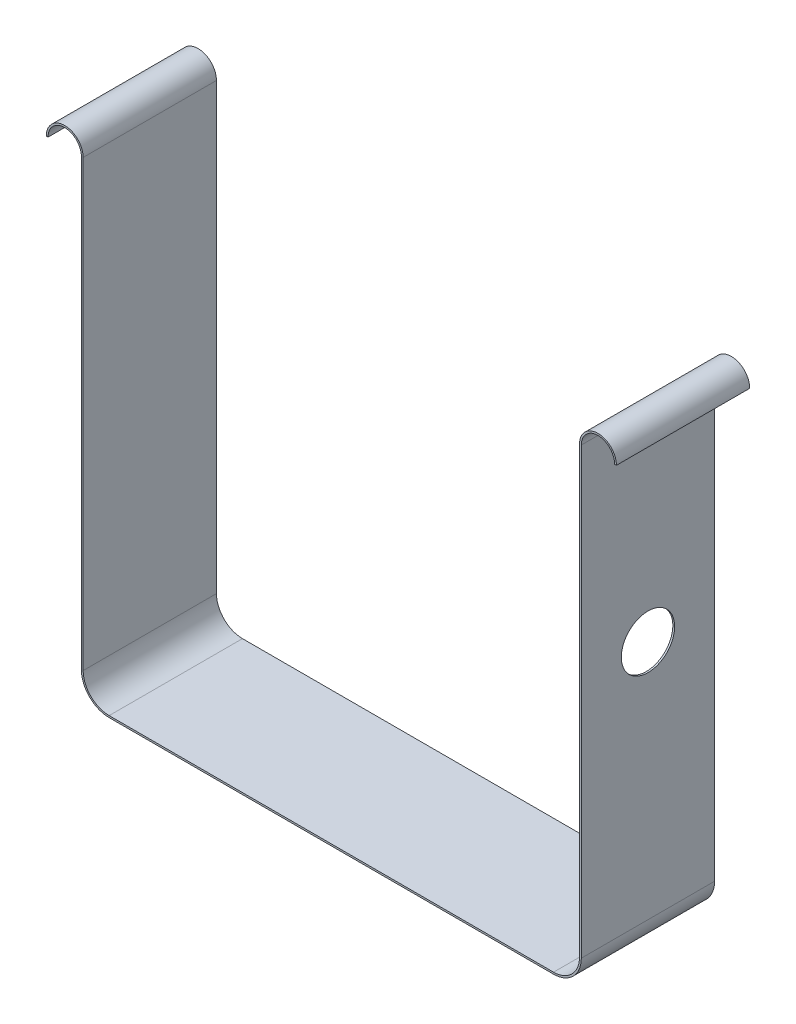
ISO-10303-21;
HEADER;
FILE_DESCRIPTION(('STEP AP214'),'2;1');
FILE_NAME('part.step','',(''),(''),'','','');
FILE_SCHEMA(('AUTOMOTIVE_DESIGN { 1 0 10303 214 1 1 1 1 }'));
ENDSEC;
DATA;
#1=APPLICATION_CONTEXT('core data for automotive mechanical design processes');
#2=APPLICATION_PROTOCOL_DEFINITION('international standard','automotive_design',2000,#1);
#3=PRODUCT_CONTEXT('',#1,'mechanical');
#4=PRODUCT('Part','Part','',(#3));
#5=PRODUCT_RELATED_PRODUCT_CATEGORY('part','',(#4));
#6=PRODUCT_DEFINITION_FORMATION('','',#4);
#7=PRODUCT_DEFINITION_CONTEXT('part definition',#1,'design');
#8=PRODUCT_DEFINITION('design','',#6,#7);
#9=PRODUCT_DEFINITION_SHAPE('','',#8);
#10=(LENGTH_UNIT() NAMED_UNIT(*) SI_UNIT(.MILLI.,.METRE.));
#11=(NAMED_UNIT(*) PLANE_ANGLE_UNIT() SI_UNIT($,.RADIAN.));
#12=(NAMED_UNIT(*) SI_UNIT($,.STERADIAN.) SOLID_ANGLE_UNIT());
#13=UNCERTAINTY_MEASURE_WITH_UNIT(LENGTH_MEASURE(1.E-05),#10,'distance_accuracy_value','');
#14=(GEOMETRIC_REPRESENTATION_CONTEXT(3) GLOBAL_UNCERTAINTY_ASSIGNED_CONTEXT((#13)) GLOBAL_UNIT_ASSIGNED_CONTEXT((#10,
#11,#12)) REPRESENTATION_CONTEXT('',''));
#15=CARTESIAN_POINT('',(0.,0.,0.));
#16=DIRECTION('',(0.,0.,1.));
#17=DIRECTION('',(1.,0.,0.));
#18=AXIS2_PLACEMENT_3D('',#15,#16,#17);
#19=CARTESIAN_POINT('',(-141.859,228.6,-38.1));
#20=DIRECTION('',(1.,0.,0.));
#21=DIRECTION('',(0.,1.,0.));
#22=AXIS2_PLACEMENT_3D('',#19,#20,#21);
#23=PLANE('',#22);
#24=DIRECTION('',(0.,1.,0.));
#25=VECTOR('',#24,1.);
#26=CARTESIAN_POINT('',(-141.859,228.6,38.1));
#27=LINE('',#26,#25);
#28=CARTESIAN_POINT('',(-141.859,-25.4,38.1));
#29=VERTEX_POINT('',#28);
#30=CARTESIAN_POINT('',(-141.859,228.6,38.1));
#31=VERTEX_POINT('',#30);
#32=EDGE_CURVE('E174',#29,#31,#27,.T.);
#33=ORIENTED_EDGE('',*,*,#32,.F.);
#34=DIRECTION('',(0.,0.,1.));
#35=VECTOR('',#34,1.);
#36=CARTESIAN_POINT('',(-141.859,-25.4,-38.1));
#37=LINE('',#36,#35);
#38=CARTESIAN_POINT('',(-141.859,-25.4,-38.1));
#39=VERTEX_POINT('',#38);
#40=EDGE_CURVE('E45',#39,#29,#37,.T.);
#41=ORIENTED_EDGE('',*,*,#40,.F.);
#42=DIRECTION('',(0.,1.,0.));
#43=VECTOR('',#42,1.);
#44=CARTESIAN_POINT('',(-141.859,228.6,-38.1));
#45=LINE('',#44,#43);
#46=CARTESIAN_POINT('',(-141.859,228.6,-38.1));
#47=VERTEX_POINT('',#46);
#48=EDGE_CURVE('E148',#39,#47,#45,.T.);
#49=ORIENTED_EDGE('',*,*,#48,.T.);
#50=DIRECTION('',(0.,0.,1.));
#51=VECTOR('',#50,1.);
#52=CARTESIAN_POINT('',(-141.859,228.6,-38.1));
#53=LINE('',#52,#51);
#54=EDGE_CURVE('E11',#47,#31,#53,.T.);
#55=ORIENTED_EDGE('',*,*,#54,.T.);
#56=EDGE_LOOP('',(#33,#41,#49,#55));
#57=FACE_BOUND('',#56,.T.);
#58=ADVANCED_FACE('F35',(#57),#23,.T.);
#59=CARTESIAN_POINT('',(-127.,-25.4,-38.1));
#60=DIRECTION('',(0.,0.,1.));
#61=DIRECTION('',(1.,0.,0.));
#62=AXIS2_PLACEMENT_3D('',#59,#60,#61);
#63=CYLINDRICAL_SURFACE('',#62,14.859);
#64=CARTESIAN_POINT('',(-127.,-25.4,38.1));
#65=DIRECTION('',(0.,0.,-1.));
#66=DIRECTION('',(-1.,0.,0.));
#67=AXIS2_PLACEMENT_3D('',#64,#65,#66);
#68=CIRCLE('',#67,14.859);
#69=CARTESIAN_POINT('',(-127.,-40.259,38.1));
#70=VERTEX_POINT('',#69);
#71=EDGE_CURVE('E172',#70,#29,#68,.T.);
#72=ORIENTED_EDGE('',*,*,#71,.F.);
#73=DIRECTION('',(0.,0.,1.));
#74=VECTOR('',#73,1.);
#75=CARTESIAN_POINT('',(-127.,-40.259,-38.1));
#76=LINE('',#75,#74);
#77=CARTESIAN_POINT('',(-127.,-40.259,-38.1));
#78=VERTEX_POINT('',#77);
#79=EDGE_CURVE('E89',#78,#70,#76,.T.);
#80=ORIENTED_EDGE('',*,*,#79,.F.);
#81=CARTESIAN_POINT('',(-127.,-25.4,-38.1));
#82=DIRECTION('',(0.,0.,-1.));
#83=DIRECTION('',(-1.,0.,0.));
#84=AXIS2_PLACEMENT_3D('',#81,#82,#83);
#85=CIRCLE('',#84,14.859);
#86=EDGE_CURVE('E138',#78,#39,#85,.T.);
#87=ORIENTED_EDGE('',*,*,#86,.T.);
#88=ORIENTED_EDGE('',*,*,#40,.T.);
#89=EDGE_LOOP('',(#72,#80,#87,#88));
#90=FACE_BOUND('',#89,.T.);
#91=ADVANCED_FACE('F224',(#90),#63,.F.);
#92=CARTESIAN_POINT('',(-127.,-40.259,-38.1));
#93=DIRECTION('',(0.,1.,0.));
#94=DIRECTION('',(-1.,0.,0.));
#95=AXIS2_PLACEMENT_3D('',#92,#93,#94);
#96=PLANE('',#95);
#97=DIRECTION('',(-1.,0.,0.));
#98=VECTOR('',#97,1.);
#99=CARTESIAN_POINT('',(-127.,-40.259,38.1));
#100=LINE('',#99,#98);
#101=CARTESIAN_POINT('',(127.,-40.259,38.1));
#102=VERTEX_POINT('',#101);
#103=EDGE_CURVE('E122',#102,#70,#100,.T.);
#104=ORIENTED_EDGE('',*,*,#103,.F.);
#105=DIRECTION('',(0.,0.,1.));
#106=VECTOR('',#105,1.);
#107=CARTESIAN_POINT('',(127.,-40.259,-38.1));
#108=LINE('',#107,#106);
#109=CARTESIAN_POINT('',(127.,-40.259,-38.1));
#110=VERTEX_POINT('',#109);
#111=EDGE_CURVE('E117',#110,#102,#108,.T.);
#112=ORIENTED_EDGE('',*,*,#111,.F.);
#113=DIRECTION('',(-1.,0.,0.));
#114=VECTOR('',#113,1.);
#115=CARTESIAN_POINT('',(-127.,-40.259,-38.1));
#116=LINE('',#115,#114);
#117=EDGE_CURVE('E120',#110,#78,#116,.T.);
#118=ORIENTED_EDGE('',*,*,#117,.T.);
#119=ORIENTED_EDGE('',*,*,#79,.T.);
#120=EDGE_LOOP('',(#104,#112,#118,#119));
#121=FACE_BOUND('',#120,.T.);
#122=ADVANCED_FACE('F119',(#121),#96,.T.);
#123=CARTESIAN_POINT('',(127.,-25.4,-38.1));
#124=DIRECTION('',(0.,0.,1.));
#125=DIRECTION('',(1.,0.,0.));
#126=AXIS2_PLACEMENT_3D('',#123,#124,#125);
#127=CYLINDRICAL_SURFACE('',#126,14.859);
#128=CARTESIAN_POINT('',(127.,-25.4,38.1));
#129=DIRECTION('',(0.,0.,-1.));
#130=DIRECTION('',(-1.,0.,0.));
#131=AXIS2_PLACEMENT_3D('',#128,#129,#130);
#132=CIRCLE('',#131,14.859);
#133=CARTESIAN_POINT('',(141.859,-25.4,38.1));
#134=VERTEX_POINT('',#133);
#135=EDGE_CURVE('E169',#134,#102,#132,.T.);
#136=ORIENTED_EDGE('',*,*,#135,.F.);
#137=DIRECTION('',(0.,0.,1.));
#138=VECTOR('',#137,1.);
#139=CARTESIAN_POINT('',(141.859,-25.4,-38.1));
#140=LINE('',#139,#138);
#141=CARTESIAN_POINT('',(141.859,-25.4,-38.1));
#142=VERTEX_POINT('',#141);
#143=EDGE_CURVE('E127',#142,#134,#140,.T.);
#144=ORIENTED_EDGE('',*,*,#143,.F.);
#145=CARTESIAN_POINT('',(127.,-25.4,-38.1));
#146=DIRECTION('',(0.,0.,-1.));
#147=DIRECTION('',(-1.,0.,0.));
#148=AXIS2_PLACEMENT_3D('',#145,#146,#147);
#149=CIRCLE('',#148,14.859);
#150=EDGE_CURVE('E135',#142,#110,#149,.T.);
#151=ORIENTED_EDGE('',*,*,#150,.T.);
#152=ORIENTED_EDGE('',*,*,#111,.T.);
#153=EDGE_LOOP('',(#136,#144,#151,#152));
#154=FACE_BOUND('',#153,.T.);
#155=ADVANCED_FACE('F140',(#154),#127,.F.);
#156=CARTESIAN_POINT('',(141.859,-25.4,-38.1));
#157=DIRECTION('',(-1.,0.,0.));
#158=DIRECTION('',(0.,-1.,0.));
#159=AXIS2_PLACEMENT_3D('',#156,#157,#158);
#160=PLANE('',#159);
#161=CARTESIAN_POINT('',(141.859,112.141,0.));
#162=DIRECTION('',(-1.,0.,0.));
#163=DIRECTION('',(0.,-1.,0.));
#164=AXIS2_PLACEMENT_3D('',#161,#162,#163);
#165=CIRCLE('',#164,15.24);
#166=CARTESIAN_POINT('',(141.859,96.9010000000001,0.));
#167=VERTEX_POINT('',#166);
#168=EDGE_CURVE('E346',#167,#167,#165,.F.);
#169=ORIENTED_EDGE('',*,*,#168,.T.);
#170=EDGE_LOOP('',(#169));
#171=FACE_BOUND('',#170,.T.);
#172=DIRECTION('',(0.,-1.,0.));
#173=VECTOR('',#172,1.);
#174=CARTESIAN_POINT('',(141.859,-25.4,38.1));
#175=LINE('',#174,#173);
#176=CARTESIAN_POINT('',(141.859,228.6,38.1));
#177=VERTEX_POINT('',#176);
#178=EDGE_CURVE('E166',#177,#134,#175,.T.);
#179=ORIENTED_EDGE('',*,*,#178,.F.);
#180=DIRECTION('',(0.,0.,1.));
#181=VECTOR('',#180,1.);
#182=CARTESIAN_POINT('',(141.859,228.6,-38.1));
#183=LINE('',#182,#181);
#184=CARTESIAN_POINT('',(141.859,228.6,-38.1));
#185=VERTEX_POINT('',#184);
#186=EDGE_CURVE('E181',#185,#177,#183,.T.);
#187=ORIENTED_EDGE('',*,*,#186,.F.);
#188=DIRECTION('',(0.,-1.,0.));
#189=VECTOR('',#188,1.);
#190=CARTESIAN_POINT('',(141.859,-25.4,-38.1));
#191=LINE('',#190,#189);
#192=EDGE_CURVE('E141',#185,#142,#191,.T.);
#193=ORIENTED_EDGE('',*,*,#192,.T.);
#194=ORIENTED_EDGE('',*,*,#143,.T.);
#195=EDGE_LOOP('',(#179,#187,#193,#194));
#196=FACE_BOUND('',#195,.T.);
#197=ADVANCED_FACE('F236',(#171,#196),#160,.T.);
#198=CARTESIAN_POINT('',(142.875,-25.4,-38.1));
#199=DIRECTION('',(1.,0.,0.));
#200=DIRECTION('',(0.,1.,0.));
#201=AXIS2_PLACEMENT_3D('',#198,#199,#200);
#202=PLANE('',#201);
#203=CARTESIAN_POINT('',(142.875,112.141,0.));
#204=DIRECTION('',(1.,0.,0.));
#205=DIRECTION('',(0.,1.,0.));
#206=AXIS2_PLACEMENT_3D('',#203,#204,#205);
#207=CIRCLE('',#206,15.24);
#208=CARTESIAN_POINT('',(142.875,127.381,0.));
#209=VERTEX_POINT('',#208);
#210=EDGE_CURVE('E338',#209,#209,#207,.T.);
#211=ORIENTED_EDGE('',*,*,#210,.F.);
#212=EDGE_LOOP('',(#211));
#213=FACE_BOUND('',#212,.T.);
#214=DIRECTION('',(0.,1.,0.));
#215=VECTOR('',#214,1.);
#216=CARTESIAN_POINT('',(142.875,-25.4,38.1));
#217=LINE('',#216,#215);
#218=CARTESIAN_POINT('',(142.875,-25.4,38.1));
#219=VERTEX_POINT('',#218);
#220=CARTESIAN_POINT('',(142.875,228.6,38.1));
#221=VERTEX_POINT('',#220);
#222=EDGE_CURVE('E163',#219,#221,#217,.T.);
#223=ORIENTED_EDGE('',*,*,#222,.F.);
#224=DIRECTION('',(0.,0.,1.));
#225=VECTOR('',#224,1.);
#226=CARTESIAN_POINT('',(142.875,-25.4,-38.1));
#227=LINE('',#226,#225);
#228=CARTESIAN_POINT('',(142.875,-25.4,-38.1));
#229=VERTEX_POINT('',#228);
#230=EDGE_CURVE('E186',#229,#219,#227,.T.);
#231=ORIENTED_EDGE('',*,*,#230,.F.);
#232=DIRECTION('',(0.,1.,0.));
#233=VECTOR('',#232,1.);
#234=CARTESIAN_POINT('',(142.875,-25.4,-38.1));
#235=LINE('',#234,#233);
#236=CARTESIAN_POINT('',(142.875,228.6,-38.1));
#237=VERTEX_POINT('',#236);
#238=EDGE_CURVE('E143',#229,#237,#235,.T.);
#239=ORIENTED_EDGE('',*,*,#238,.T.);
#240=DIRECTION('',(0.,0.,1.));
#241=VECTOR('',#240,1.);
#242=CARTESIAN_POINT('',(142.875,228.6,-38.1));
#243=LINE('',#242,#241);
#244=EDGE_CURVE('E183',#237,#221,#243,.T.);
#245=ORIENTED_EDGE('',*,*,#244,.T.);
#246=EDGE_LOOP('',(#223,#231,#239,#245));
#247=FACE_BOUND('',#246,.T.);
#248=ADVANCED_FACE('F239',(#213,#247),#202,.T.);
#249=CARTESIAN_POINT('',(127.,-25.4,-38.1));
#250=DIRECTION('',(0.,0.,1.));
#251=DIRECTION('',(1.,0.,0.));
#252=AXIS2_PLACEMENT_3D('',#249,#250,#251);
#253=CYLINDRICAL_SURFACE('',#252,15.875);
#254=CARTESIAN_POINT('',(127.,-25.4,38.1));
#255=DIRECTION('',(0.,0.,1.));
#256=DIRECTION('',(-1.,0.,0.));
#257=AXIS2_PLACEMENT_3D('',#254,#255,#256);
#258=CIRCLE('',#257,15.875);
#259=CARTESIAN_POINT('',(127.,-41.275,38.1));
#260=VERTEX_POINT('',#259);
#261=EDGE_CURVE('E160',#260,#219,#258,.T.);
#262=ORIENTED_EDGE('',*,*,#261,.F.);
#263=DIRECTION('',(0.,0.,1.));
#264=VECTOR('',#263,1.);
#265=CARTESIAN_POINT('',(127.,-41.275,-38.1));
#266=LINE('',#265,#264);
#267=CARTESIAN_POINT('',(127.,-41.275,-38.1));
#268=VERTEX_POINT('',#267);
#269=EDGE_CURVE('E188',#268,#260,#266,.T.);
#270=ORIENTED_EDGE('',*,*,#269,.F.);
#271=CARTESIAN_POINT('',(127.,-25.4,-38.1));
#272=DIRECTION('',(0.,0.,1.));
#273=DIRECTION('',(-1.,0.,0.));
#274=AXIS2_PLACEMENT_3D('',#271,#272,#273);
#275=CIRCLE('',#274,15.875);
#276=EDGE_CURVE('E259',#268,#229,#275,.T.);
#277=ORIENTED_EDGE('',*,*,#276,.T.);
#278=ORIENTED_EDGE('',*,*,#230,.T.);
#279=EDGE_LOOP('',(#262,#270,#277,#278));
#280=FACE_BOUND('',#279,.T.);
#281=ADVANCED_FACE('F243',(#280),#253,.T.);
#282=CARTESIAN_POINT('',(-127.,-41.275,-38.1));
#283=DIRECTION('',(0.,-1.,0.));
#284=DIRECTION('',(0.,0.,-1.));
#285=AXIS2_PLACEMENT_3D('',#282,#283,#284);
#286=PLANE('',#285);
#287=DIRECTION('',(1.,0.,0.));
#288=VECTOR('',#287,1.);
#289=CARTESIAN_POINT('',(-127.,-41.275,38.1));
#290=LINE('',#289,#288);
#291=CARTESIAN_POINT('',(-127.,-41.275,38.1));
#292=VERTEX_POINT('',#291);
#293=EDGE_CURVE('E157',#292,#260,#290,.T.);
#294=ORIENTED_EDGE('',*,*,#293,.F.);
#295=DIRECTION('',(0.,0.,1.));
#296=VECTOR('',#295,1.);
#297=CARTESIAN_POINT('',(-127.,-41.275,-38.1));
#298=LINE('',#297,#296);
#299=CARTESIAN_POINT('',(-127.,-41.275,-38.1));
#300=VERTEX_POINT('',#299);
#301=EDGE_CURVE('E190',#300,#292,#298,.T.);
#302=ORIENTED_EDGE('',*,*,#301,.F.);
#303=DIRECTION('',(1.,0.,0.));
#304=VECTOR('',#303,1.);
#305=CARTESIAN_POINT('',(-127.,-41.275,-38.1));
#306=LINE('',#305,#304);
#307=EDGE_CURVE('E257',#300,#268,#306,.T.);
#308=ORIENTED_EDGE('',*,*,#307,.T.);
#309=ORIENTED_EDGE('',*,*,#269,.T.);
#310=EDGE_LOOP('',(#294,#302,#308,#309));
#311=FACE_BOUND('',#310,.T.);
#312=ADVANCED_FACE('F222',(#311),#286,.T.);
#313=CARTESIAN_POINT('',(-127.,-25.4,-38.1));
#314=DIRECTION('',(0.,0.,1.));
#315=DIRECTION('',(1.,0.,0.));
#316=AXIS2_PLACEMENT_3D('',#313,#314,#315);
#317=CYLINDRICAL_SURFACE('',#316,15.875);
#318=CARTESIAN_POINT('',(-127.,-25.4,38.1));
#319=DIRECTION('',(0.,0.,1.));
#320=DIRECTION('',(-1.,0.,0.));
#321=AXIS2_PLACEMENT_3D('',#318,#319,#320);
#322=CIRCLE('',#321,15.875);
#323=CARTESIAN_POINT('',(-142.875,-25.3999999999999,38.1));
#324=VERTEX_POINT('',#323);
#325=EDGE_CURVE('E153',#324,#292,#322,.T.);
#326=ORIENTED_EDGE('',*,*,#325,.F.);
#327=DIRECTION('',(0.,0.,1.));
#328=VECTOR('',#327,1.);
#329=CARTESIAN_POINT('',(-142.875,-25.3999999999999,-38.1));
#330=LINE('',#329,#328);
#331=CARTESIAN_POINT('',(-142.875,-25.3999999999999,-38.1));
#332=VERTEX_POINT('',#331);
#333=EDGE_CURVE('E100',#332,#324,#330,.T.);
#334=ORIENTED_EDGE('',*,*,#333,.F.);
#335=CARTESIAN_POINT('',(-127.,-25.4,-38.1));
#336=DIRECTION('',(0.,0.,1.));
#337=DIRECTION('',(-1.,0.,0.));
#338=AXIS2_PLACEMENT_3D('',#335,#336,#337);
#339=CIRCLE('',#338,15.875);
#340=EDGE_CURVE('E256',#332,#300,#339,.T.);
#341=ORIENTED_EDGE('',*,*,#340,.T.);
#342=ORIENTED_EDGE('',*,*,#301,.T.);
#343=EDGE_LOOP('',(#326,#334,#341,#342));
#344=FACE_BOUND('',#343,.T.);
#345=ADVANCED_FACE('F216',(#344),#317,.T.);
#346=CARTESIAN_POINT('',(-142.875,228.6,-38.1));
#347=DIRECTION('',(-1.,0.,0.));
#348=DIRECTION('',(0.,-1.,0.));
#349=AXIS2_PLACEMENT_3D('',#346,#347,#348);
#350=PLANE('',#349);
#351=DIRECTION('',(0.,-1.,0.));
#352=VECTOR('',#351,1.);
#353=CARTESIAN_POINT('',(-142.875,228.6,38.1));
#354=LINE('',#353,#352);
#355=CARTESIAN_POINT('',(-142.875,228.6,38.1));
#356=VERTEX_POINT('',#355);
#357=EDGE_CURVE('E150',#356,#324,#354,.T.);
#358=ORIENTED_EDGE('',*,*,#357,.F.);
#359=DIRECTION('',(0.,0.,1.));
#360=VECTOR('',#359,1.);
#361=CARTESIAN_POINT('',(-142.875,228.6,-38.1));
#362=LINE('',#361,#360);
#363=CARTESIAN_POINT('',(-142.875,228.6,-38.1));
#364=VERTEX_POINT('',#363);
#365=EDGE_CURVE('E39',#364,#356,#362,.T.);
#366=ORIENTED_EDGE('',*,*,#365,.F.);
#367=DIRECTION('',(0.,-1.,0.));
#368=VECTOR('',#367,1.);
#369=CARTESIAN_POINT('',(-142.875,228.6,-38.1));
#370=LINE('',#369,#368);
#371=EDGE_CURVE('E176',#364,#332,#370,.T.);
#372=ORIENTED_EDGE('',*,*,#371,.T.);
#373=ORIENTED_EDGE('',*,*,#333,.T.);
#374=EDGE_LOOP('',(#358,#366,#372,#373));
#375=FACE_BOUND('',#374,.T.);
#376=ADVANCED_FACE('F37',(#375),#350,.T.);
#377=CARTESIAN_POINT('',(-127.,-25.4,-38.1));
#378=DIRECTION('',(0.,0.,-1.));
#379=DIRECTION('',(-1.,0.,0.));
#380=AXIS2_PLACEMENT_3D('',#377,#378,#379);
#381=PLANE('',#380);
#382=ORIENTED_EDGE('',*,*,#371,.F.);
#383=CARTESIAN_POINT('',(-152.4,228.6,-38.1));
#384=DIRECTION('',(0.,0.,-1.));
#385=DIRECTION('',(-1.,0.,0.));
#386=AXIS2_PLACEMENT_3D('',#383,#384,#385);
#387=CIRCLE('',#386,9.52500000000001);
#388=CARTESIAN_POINT('',(-161.925,228.6,-38.1));
#389=VERTEX_POINT('',#388);
#390=EDGE_CURVE('E204',#389,#364,#387,.T.);
#391=ORIENTED_EDGE('',*,*,#390,.F.);
#392=DIRECTION('',(1.,0.,0.));
#393=VECTOR('',#392,1.);
#394=CARTESIAN_POINT('',(-161.925,228.6,-38.1));
#395=LINE('',#394,#393);
#396=CARTESIAN_POINT('',(-162.941,228.6,-38.1));
#397=VERTEX_POINT('',#396);
#398=EDGE_CURVE('E213',#397,#389,#395,.T.);
#399=ORIENTED_EDGE('',*,*,#398,.F.);
#400=CARTESIAN_POINT('',(-152.4,228.6,-38.1));
#401=DIRECTION('',(0.,0.,1.));
#402=DIRECTION('',(-1.,0.,0.));
#403=AXIS2_PLACEMENT_3D('',#400,#401,#402);
#404=CIRCLE('',#403,10.541);
#405=EDGE_CURVE('E312',#47,#397,#404,.T.);
#406=ORIENTED_EDGE('',*,*,#405,.F.);
#407=ORIENTED_EDGE('',*,*,#48,.F.);
#408=ORIENTED_EDGE('',*,*,#86,.F.);
#409=ORIENTED_EDGE('',*,*,#117,.F.);
#410=ORIENTED_EDGE('',*,*,#150,.F.);
#411=ORIENTED_EDGE('',*,*,#192,.F.);
#412=CARTESIAN_POINT('',(152.4,228.6,-38.1));
#413=DIRECTION('',(0.,0.,1.));
#414=DIRECTION('',(1.,0.,0.));
#415=AXIS2_PLACEMENT_3D('',#412,#413,#414);
#416=CIRCLE('',#415,10.541);
#417=CARTESIAN_POINT('',(162.941,228.6,-38.1));
#418=VERTEX_POINT('',#417);
#419=EDGE_CURVE('E333',#418,#185,#416,.T.);
#420=ORIENTED_EDGE('',*,*,#419,.F.);
#421=DIRECTION('',(1.,0.,0.));
#422=VECTOR('',#421,1.);
#423=CARTESIAN_POINT('',(161.925,228.6,-38.1));
#424=LINE('',#423,#422);
#425=CARTESIAN_POINT('',(161.925,228.6,-38.1));
#426=VERTEX_POINT('',#425);
#427=EDGE_CURVE('E335',#426,#418,#424,.T.);
#428=ORIENTED_EDGE('',*,*,#427,.F.);
#429=CARTESIAN_POINT('',(152.4,228.6,-38.1));
#430=DIRECTION('',(0.,0.,-1.));
#431=DIRECTION('',(1.,0.,0.));
#432=AXIS2_PLACEMENT_3D('',#429,#430,#431);
#433=CIRCLE('',#432,9.52500000000001);
#434=EDGE_CURVE('E279',#237,#426,#433,.T.);
#435=ORIENTED_EDGE('',*,*,#434,.F.);
#436=ORIENTED_EDGE('',*,*,#238,.F.);
#437=ORIENTED_EDGE('',*,*,#276,.F.);
#438=ORIENTED_EDGE('',*,*,#307,.F.);
#439=ORIENTED_EDGE('',*,*,#340,.F.);
#440=EDGE_LOOP('',(#382,#391,#399,#406,#407,#408,#409,#410,#411,#420,#428,#435,#436,#437,#438,#439));
#441=FACE_BOUND('',#440,.T.);
#442=ADVANCED_FACE('F133',(#441),#381,.T.);
#443=CARTESIAN_POINT('',(-127.,-25.4,38.1));
#444=DIRECTION('',(0.,0.,-1.));
#445=DIRECTION('',(-1.,0.,0.));
#446=AXIS2_PLACEMENT_3D('',#443,#444,#445);
#447=PLANE('',#446);
#448=ORIENTED_EDGE('',*,*,#32,.T.);
#449=CARTESIAN_POINT('',(-152.4,228.6,38.1));
#450=DIRECTION('',(0.,0.,1.));
#451=DIRECTION('',(-1.,0.,0.));
#452=AXIS2_PLACEMENT_3D('',#449,#450,#451);
#453=CIRCLE('',#452,10.541);
#454=CARTESIAN_POINT('',(-162.941,228.6,38.1));
#455=VERTEX_POINT('',#454);
#456=EDGE_CURVE('E212',#31,#455,#453,.T.);
#457=ORIENTED_EDGE('',*,*,#456,.T.);
#458=DIRECTION('',(1.,0.,0.));
#459=VECTOR('',#458,1.);
#460=CARTESIAN_POINT('',(-161.925,228.6,38.1));
#461=LINE('',#460,#459);
#462=CARTESIAN_POINT('',(-161.925,228.6,38.1));
#463=VERTEX_POINT('',#462);
#464=EDGE_CURVE('E210',#455,#463,#461,.T.);
#465=ORIENTED_EDGE('',*,*,#464,.T.);
#466=CARTESIAN_POINT('',(-152.4,228.6,38.1));
#467=DIRECTION('',(0.,0.,-1.));
#468=DIRECTION('',(-1.,0.,0.));
#469=AXIS2_PLACEMENT_3D('',#466,#467,#468);
#470=CIRCLE('',#469,9.52500000000001);
#471=EDGE_CURVE('E201',#463,#356,#470,.T.);
#472=ORIENTED_EDGE('',*,*,#471,.T.);
#473=ORIENTED_EDGE('',*,*,#357,.T.);
#474=ORIENTED_EDGE('',*,*,#325,.T.);
#475=ORIENTED_EDGE('',*,*,#293,.T.);
#476=ORIENTED_EDGE('',*,*,#261,.T.);
#477=ORIENTED_EDGE('',*,*,#222,.T.);
#478=CARTESIAN_POINT('',(152.4,228.6,38.1));
#479=DIRECTION('',(0.,0.,-1.));
#480=DIRECTION('',(1.,0.,0.));
#481=AXIS2_PLACEMENT_3D('',#478,#479,#480);
#482=CIRCLE('',#481,9.52500000000001);
#483=CARTESIAN_POINT('',(161.925,228.6,38.1));
#484=VERTEX_POINT('',#483);
#485=EDGE_CURVE('E283',#221,#484,#482,.T.);
#486=ORIENTED_EDGE('',*,*,#485,.T.);
#487=DIRECTION('',(1.,0.,0.));
#488=VECTOR('',#487,1.);
#489=CARTESIAN_POINT('',(161.925,228.6,38.1));
#490=LINE('',#489,#488);
#491=CARTESIAN_POINT('',(162.941,228.6,38.1));
#492=VERTEX_POINT('',#491);
#493=EDGE_CURVE('E341',#484,#492,#490,.T.);
#494=ORIENTED_EDGE('',*,*,#493,.T.);
#495=CARTESIAN_POINT('',(152.4,228.6,38.1));
#496=DIRECTION('',(0.,0.,1.));
#497=DIRECTION('',(1.,0.,0.));
#498=AXIS2_PLACEMENT_3D('',#495,#496,#497);
#499=CIRCLE('',#498,10.541);
#500=EDGE_CURVE('E332',#492,#177,#499,.T.);
#501=ORIENTED_EDGE('',*,*,#500,.T.);
#502=ORIENTED_EDGE('',*,*,#178,.T.);
#503=ORIENTED_EDGE('',*,*,#135,.T.);
#504=ORIENTED_EDGE('',*,*,#103,.T.);
#505=ORIENTED_EDGE('',*,*,#71,.T.);
#506=EDGE_LOOP('',(#448,#457,#465,#472,#473,#474,#475,#476,#477,#486,#494,#501,#502,#503,#504,#505));
#507=FACE_BOUND('',#506,.T.);
#508=ADVANCED_FACE('F207',(#507),#447,.F.);
#509=CARTESIAN_POINT('',(-152.4,228.6,38.1));
#510=DIRECTION('',(0.,0.,-1.));
#511=DIRECTION('',(-1.,0.,0.));
#512=AXIS2_PLACEMENT_3D('',#509,#510,#511);
#513=CYLINDRICAL_SURFACE('',#512,9.52500000000001);
#514=ORIENTED_EDGE('',*,*,#390,.T.);
#515=ORIENTED_EDGE('',*,*,#365,.T.);
#516=ORIENTED_EDGE('',*,*,#471,.F.);
#517=DIRECTION('',(0.,0.,-1.));
#518=VECTOR('',#517,1.);
#519=CARTESIAN_POINT('',(-161.925,228.6,38.1));
#520=LINE('',#519,#518);
#521=EDGE_CURVE('E318',#463,#389,#520,.T.);
#522=ORIENTED_EDGE('',*,*,#521,.T.);
#523=EDGE_LOOP('',(#514,#515,#516,#522));
#524=FACE_BOUND('',#523,.T.);
#525=ADVANCED_FACE('F199',(#524),#513,.F.);
#526=CARTESIAN_POINT('',(-152.4,228.6,38.1));
#527=DIRECTION('',(0.,0.,-1.));
#528=DIRECTION('',(-1.,0.,0.));
#529=AXIS2_PLACEMENT_3D('',#526,#527,#528);
#530=CYLINDRICAL_SURFACE('',#529,10.541);
#531=ORIENTED_EDGE('',*,*,#405,.T.);
#532=DIRECTION('',(0.,0.,-1.));
#533=VECTOR('',#532,1.);
#534=CARTESIAN_POINT('',(-162.941,228.6,38.1));
#535=LINE('',#534,#533);
#536=EDGE_CURVE('E154',#455,#397,#535,.T.);
#537=ORIENTED_EDGE('',*,*,#536,.F.);
#538=ORIENTED_EDGE('',*,*,#456,.F.);
#539=ORIENTED_EDGE('',*,*,#54,.F.);
#540=EDGE_LOOP('',(#531,#537,#538,#539));
#541=FACE_BOUND('',#540,.T.);
#542=ADVANCED_FACE('F372',(#541),#530,.T.);
#543=CARTESIAN_POINT('',(-161.925,228.6,38.1));
#544=DIRECTION('',(0.,1.,0.));
#545=DIRECTION('',(0.,0.,1.));
#546=AXIS2_PLACEMENT_3D('',#543,#544,#545);
#547=PLANE('',#546);
#548=ORIENTED_EDGE('',*,*,#398,.T.);
#549=ORIENTED_EDGE('',*,*,#521,.F.);
#550=ORIENTED_EDGE('',*,*,#464,.F.);
#551=ORIENTED_EDGE('',*,*,#536,.T.);
#552=EDGE_LOOP('',(#548,#549,#550,#551));
#553=FACE_BOUND('',#552,.T.);
#554=ADVANCED_FACE('F317',(#553),#547,.F.);
#555=CARTESIAN_POINT('',(152.4,228.6,38.1));
#556=DIRECTION('',(0.,0.,-1.));
#557=DIRECTION('',(-1.,0.,0.));
#558=AXIS2_PLACEMENT_3D('',#555,#556,#557);
#559=CYLINDRICAL_SURFACE('',#558,9.52500000000001);
#560=ORIENTED_EDGE('',*,*,#434,.T.);
#561=DIRECTION('',(0.,0.,-1.));
#562=VECTOR('',#561,1.);
#563=CARTESIAN_POINT('',(161.925,228.6,38.1));
#564=LINE('',#563,#562);
#565=EDGE_CURVE('E321',#484,#426,#564,.T.);
#566=ORIENTED_EDGE('',*,*,#565,.F.);
#567=ORIENTED_EDGE('',*,*,#485,.F.);
#568=ORIENTED_EDGE('',*,*,#244,.F.);
#569=EDGE_LOOP('',(#560,#566,#567,#568));
#570=FACE_BOUND('',#569,.T.);
#571=ADVANCED_FACE('F366',(#570),#559,.F.);
#572=CARTESIAN_POINT('',(161.925,228.6,38.1));
#573=DIRECTION('',(0.,1.,0.));
#574=DIRECTION('',(0.,0.,1.));
#575=AXIS2_PLACEMENT_3D('',#572,#573,#574);
#576=PLANE('',#575);
#577=ORIENTED_EDGE('',*,*,#427,.T.);
#578=DIRECTION('',(0.,0.,-1.));
#579=VECTOR('',#578,1.);
#580=CARTESIAN_POINT('',(162.941,228.6,38.1));
#581=LINE('',#580,#579);
#582=EDGE_CURVE('E325',#492,#418,#581,.T.);
#583=ORIENTED_EDGE('',*,*,#582,.F.);
#584=ORIENTED_EDGE('',*,*,#493,.F.);
#585=ORIENTED_EDGE('',*,*,#565,.T.);
#586=EDGE_LOOP('',(#577,#583,#584,#585));
#587=FACE_BOUND('',#586,.T.);
#588=ADVANCED_FACE('F360',(#587),#576,.F.);
#589=CARTESIAN_POINT('',(152.4,228.6,38.1));
#590=DIRECTION('',(0.,0.,-1.));
#591=DIRECTION('',(-1.,0.,0.));
#592=AXIS2_PLACEMENT_3D('',#589,#590,#591);
#593=CYLINDRICAL_SURFACE('',#592,10.541);
#594=ORIENTED_EDGE('',*,*,#419,.T.);
#595=ORIENTED_EDGE('',*,*,#186,.T.);
#596=ORIENTED_EDGE('',*,*,#500,.F.);
#597=ORIENTED_EDGE('',*,*,#582,.T.);
#598=EDGE_LOOP('',(#594,#595,#596,#597));
#599=FACE_BOUND('',#598,.T.);
#600=ADVANCED_FACE('F354',(#599),#593,.T.);
#601=CARTESIAN_POINT('',(-162.942,112.141,0.));
#602=DIRECTION('',(1.,0.,0.));
#603=DIRECTION('',(0.,1.,0.));
#604=AXIS2_PLACEMENT_3D('',#601,#602,#603);
#605=CYLINDRICAL_SURFACE('',#604,15.24);
#606=ORIENTED_EDGE('',*,*,#168,.F.);
#607=EDGE_LOOP('',(#606));
#608=FACE_BOUND('',#607,.T.);
#609=ORIENTED_EDGE('',*,*,#210,.T.);
#610=EDGE_LOOP('',(#609));
#611=FACE_BOUND('',#610,.T.);
#612=ADVANCED_FACE('F351',(#608,#611),#605,.F.);
#613=CLOSED_SHELL('',(#58,#91,#122,#155,#197,#248,#281,#312,#345,#376,#442,#508,#525,#542,#554,
#571,#588,#600,#612));
#614=MANIFOLD_SOLID_BREP('B2',#613);
#615=ADVANCED_BREP_SHAPE_REPRESENTATION('',(#18,#614),#14);
#616=SHAPE_DEFINITION_REPRESENTATION(#9,#615);
ENDSEC;
END-ISO-10303-21;
